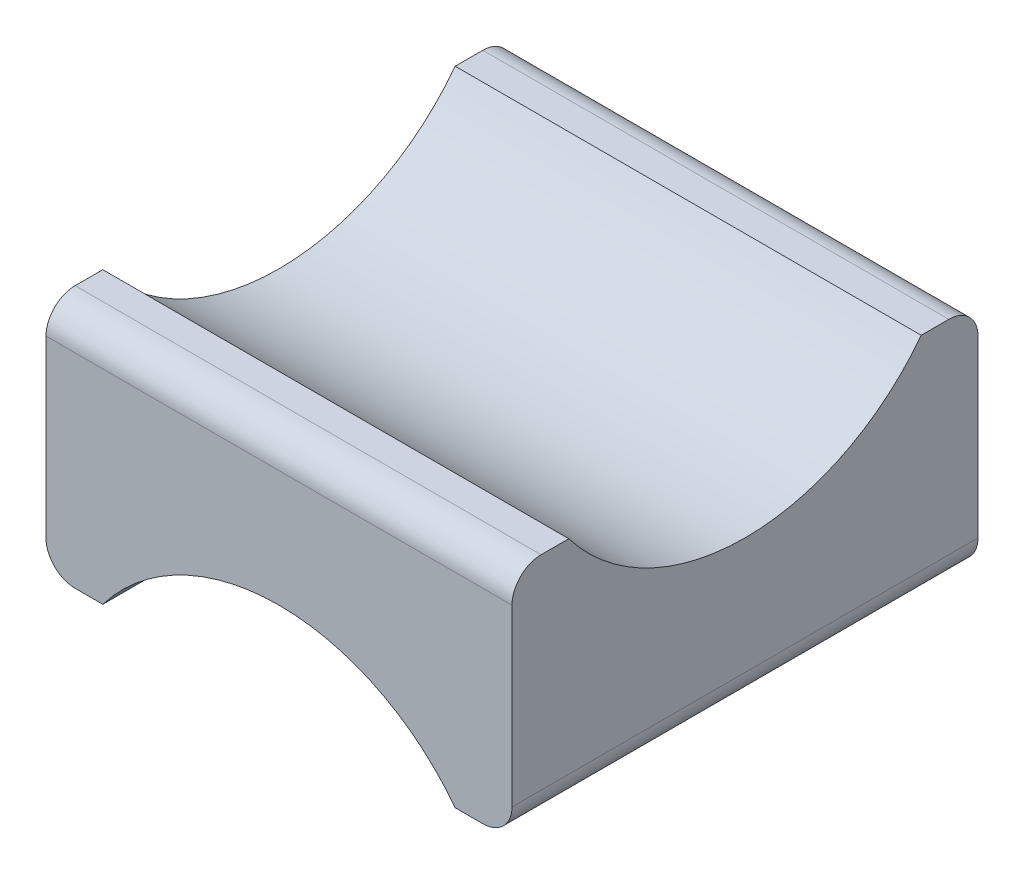
ISO-10303-21;
HEADER;
FILE_DESCRIPTION(('STEP AP214'),'2;1');
FILE_NAME('part.step','',(''),(''),'','','');
FILE_SCHEMA(('AUTOMOTIVE_DESIGN { 1 0 10303 214 1 1 1 1 }'));
ENDSEC;
DATA;
#1=APPLICATION_CONTEXT('core data for automotive mechanical design processes');
#2=APPLICATION_PROTOCOL_DEFINITION('international standard','automotive_design',2000,#1);
#3=PRODUCT_CONTEXT('',#1,'mechanical');
#4=PRODUCT('Part','Part','',(#3));
#5=PRODUCT_RELATED_PRODUCT_CATEGORY('part','',(#4));
#6=PRODUCT_DEFINITION_FORMATION('','',#4);
#7=PRODUCT_DEFINITION_CONTEXT('part definition',#1,'design');
#8=PRODUCT_DEFINITION('design','',#6,#7);
#9=PRODUCT_DEFINITION_SHAPE('','',#8);
#10=(LENGTH_UNIT() NAMED_UNIT(*) SI_UNIT(.MILLI.,.METRE.));
#11=(NAMED_UNIT(*) PLANE_ANGLE_UNIT() SI_UNIT($,.RADIAN.));
#12=(NAMED_UNIT(*) SI_UNIT($,.STERADIAN.) SOLID_ANGLE_UNIT());
#13=UNCERTAINTY_MEASURE_WITH_UNIT(LENGTH_MEASURE(1.E-05),#10,'distance_accuracy_value','');
#14=(GEOMETRIC_REPRESENTATION_CONTEXT(3) GLOBAL_UNCERTAINTY_ASSIGNED_CONTEXT((#13)) GLOBAL_UNIT_ASSIGNED_CONTEXT((#10,
#11,#12)) REPRESENTATION_CONTEXT('',''));
#15=CARTESIAN_POINT('',(0.,0.,0.));
#16=DIRECTION('',(0.,0.,1.));
#17=DIRECTION('',(1.,0.,0.));
#18=AXIS2_PLACEMENT_3D('',#15,#16,#17);
#19=CARTESIAN_POINT('',(8.,4.,8.));
#20=DIRECTION('',(0.,-1.,0.));
#21=DIRECTION('',(1.,0.,0.));
#22=AXIS2_PLACEMENT_3D('',#19,#20,#21);
#23=PLANE('',#22);
#24=DIRECTION('',(0.,0.,-1.));
#25=VECTOR('',#24,1.);
#26=CARTESIAN_POINT('',(-8.,4.,8.));
#27=LINE('',#26,#25);
#28=CARTESIAN_POINT('',(-8.,4.,7.));
#29=VERTEX_POINT('',#28);
#30=CARTESIAN_POINT('',(-8.,4.,6.04979338490167));
#31=VERTEX_POINT('',#30);
#32=EDGE_CURVE('E122',#29,#31,#27,.T.);
#33=ORIENTED_EDGE('',*,*,#32,.F.);
#34=DIRECTION('',(-1.,0.,0.));
#35=VECTOR('',#34,1.);
#36=CARTESIAN_POINT('',(8.,4.,7.));
#37=LINE('',#36,#35);
#38=CARTESIAN_POINT('',(8.,4.,7.));
#39=VERTEX_POINT('',#38);
#40=EDGE_CURVE('E40',#29,#39,#37,.F.);
#41=ORIENTED_EDGE('',*,*,#40,.T.);
#42=DIRECTION('',(0.,0.,-1.));
#43=VECTOR('',#42,1.);
#44=CARTESIAN_POINT('',(8.,4.,8.));
#45=LINE('',#44,#43);
#46=CARTESIAN_POINT('',(8.,4.,6.04979338490167));
#47=VERTEX_POINT('',#46);
#48=EDGE_CURVE('E143',#39,#47,#45,.T.);
#49=ORIENTED_EDGE('',*,*,#48,.T.);
#50=DIRECTION('',(-1.,0.,0.));
#51=VECTOR('',#50,1.);
#52=CARTESIAN_POINT('',(18.,4.,6.04979338490167));
#53=LINE('',#52,#51);
#54=EDGE_CURVE('E138',#47,#31,#53,.T.);
#55=ORIENTED_EDGE('',*,*,#54,.T.);
#56=EDGE_LOOP('',(#33,#41,#49,#55));
#57=FACE_BOUND('',#56,.T.);
#58=ADVANCED_FACE('F32',(#57),#23,.F.);
#59=CARTESIAN_POINT('',(8.,4.,8.));
#60=DIRECTION('',(-1.,0.,0.));
#61=DIRECTION('',(0.,0.,1.));
#62=AXIS2_PLACEMENT_3D('',#59,#60,#61);
#63=PLANE('',#62);
#64=DIRECTION('',(0.,1.,0.));
#65=VECTOR('',#64,1.);
#66=CARTESIAN_POINT('',(8.,4.,8.));
#67=LINE('',#66,#65);
#68=CARTESIAN_POINT('',(8.,-3.,8.));
#69=VERTEX_POINT('',#68);
#70=CARTESIAN_POINT('',(8.,3.,8.));
#71=VERTEX_POINT('',#70);
#72=EDGE_CURVE('E153',#69,#71,#67,.T.);
#73=ORIENTED_EDGE('',*,*,#72,.F.);
#74=DIRECTION('',(0.,0.,-1.));
#75=VECTOR('',#74,1.);
#76=CARTESIAN_POINT('',(8.,-3.,8.));
#77=LINE('',#76,#75);
#78=CARTESIAN_POINT('',(8.,-3.,-8.));
#79=VERTEX_POINT('',#78);
#80=EDGE_CURVE('E204',#69,#79,#77,.T.);
#81=ORIENTED_EDGE('',*,*,#80,.T.);
#82=DIRECTION('',(0.,1.,0.));
#83=VECTOR('',#82,1.);
#84=CARTESIAN_POINT('',(8.,4.,-8.));
#85=LINE('',#84,#83);
#86=CARTESIAN_POINT('',(8.,3.,-8.));
#87=VERTEX_POINT('',#86);
#88=EDGE_CURVE('E145',#79,#87,#85,.T.);
#89=ORIENTED_EDGE('',*,*,#88,.T.);
#90=CARTESIAN_POINT('',(8.,3.,-7.));
#91=DIRECTION('',(-1.,0.,0.));
#92=DIRECTION('',(0.,0.,1.));
#93=AXIS2_PLACEMENT_3D('',#90,#91,#92);
#94=CIRCLE('',#93,1.);
#95=CARTESIAN_POINT('',(8.,4.,-7.));
#96=VERTEX_POINT('',#95);
#97=EDGE_CURVE('E54',#87,#96,#94,.F.);
#98=ORIENTED_EDGE('',*,*,#97,.T.);
#99=CARTESIAN_POINT('',(8.,4.,-6.04979338490167));
#100=VERTEX_POINT('',#99);
#101=EDGE_CURVE('E132',#100,#96,#45,.T.);
#102=ORIENTED_EDGE('',*,*,#101,.F.);
#103=CARTESIAN_POINT('',(8.,8.6,0.));
#104=DIRECTION('',(-1.,0.,0.));
#105=DIRECTION('',(0.,0.,1.));
#106=AXIS2_PLACEMENT_3D('',#103,#104,#105);
#107=CIRCLE('',#106,7.6);
#108=EDGE_CURVE('E146',#100,#47,#107,.T.);
#109=ORIENTED_EDGE('',*,*,#108,.T.);
#110=ORIENTED_EDGE('',*,*,#48,.F.);
#111=CARTESIAN_POINT('',(8.,3.,7.));
#112=DIRECTION('',(-1.,0.,0.));
#113=DIRECTION('',(0.,0.,1.));
#114=AXIS2_PLACEMENT_3D('',#111,#112,#113);
#115=CIRCLE('',#114,1.);
#116=EDGE_CURVE('E202',#39,#71,#115,.F.);
#117=ORIENTED_EDGE('',*,*,#116,.T.);
#118=EDGE_LOOP('',(#73,#81,#89,#98,#102,#109,#110,#117));
#119=FACE_BOUND('',#118,.T.);
#120=ADVANCED_FACE('F223',(#119),#63,.F.);
#121=ORIENTED_EDGE('',*,*,#101,.T.);
#122=DIRECTION('',(-1.,0.,0.));
#123=VECTOR('',#122,1.);
#124=CARTESIAN_POINT('',(8.,4.,-7.));
#125=LINE('',#124,#123);
#126=CARTESIAN_POINT('',(-8.,4.,-7.));
#127=VERTEX_POINT('',#126);
#128=EDGE_CURVE('E11',#96,#127,#125,.T.);
#129=ORIENTED_EDGE('',*,*,#128,.T.);
#130=CARTESIAN_POINT('',(-8.,4.,-6.04979338490167));
#131=VERTEX_POINT('',#130);
#132=EDGE_CURVE('E133',#131,#127,#27,.T.);
#133=ORIENTED_EDGE('',*,*,#132,.F.);
#134=DIRECTION('',(-1.,0.,0.));
#135=VECTOR('',#134,1.);
#136=CARTESIAN_POINT('',(18.,4.,-6.04979338490167));
#137=LINE('',#136,#135);
#138=EDGE_CURVE('E141',#131,#100,#137,.F.);
#139=ORIENTED_EDGE('',*,*,#138,.T.);
#140=EDGE_LOOP('',(#121,#129,#133,#139));
#141=FACE_BOUND('',#140,.T.);
#142=ADVANCED_FACE('F232',(#141),#23,.F.);
#143=CARTESIAN_POINT('',(-8.,4.,8.));
#144=DIRECTION('',(1.,0.,0.));
#145=DIRECTION('',(0.,0.,-1.));
#146=AXIS2_PLACEMENT_3D('',#143,#144,#145);
#147=PLANE('',#146);
#148=DIRECTION('',(0.,-1.,0.));
#149=VECTOR('',#148,1.);
#150=CARTESIAN_POINT('',(-8.,4.,-8.));
#151=LINE('',#150,#149);
#152=CARTESIAN_POINT('',(-8.,3.,-8.));
#153=VERTEX_POINT('',#152);
#154=CARTESIAN_POINT('',(-8.,-3.,-8.));
#155=VERTEX_POINT('',#154);
#156=EDGE_CURVE('E148',#153,#155,#151,.T.);
#157=ORIENTED_EDGE('',*,*,#156,.T.);
#158=DIRECTION('',(0.,0.,-1.));
#159=VECTOR('',#158,1.);
#160=CARTESIAN_POINT('',(-8.,-3.,8.));
#161=LINE('',#160,#159);
#162=CARTESIAN_POINT('',(-8.,-3.,8.));
#163=VERTEX_POINT('',#162);
#164=EDGE_CURVE('E192',#155,#163,#161,.F.);
#165=ORIENTED_EDGE('',*,*,#164,.T.);
#166=DIRECTION('',(0.,-1.,0.));
#167=VECTOR('',#166,1.);
#168=CARTESIAN_POINT('',(-8.,4.,8.));
#169=LINE('',#168,#167);
#170=CARTESIAN_POINT('',(-8.,3.,8.));
#171=VERTEX_POINT('',#170);
#172=EDGE_CURVE('E156',#171,#163,#169,.T.);
#173=ORIENTED_EDGE('',*,*,#172,.F.);
#174=CARTESIAN_POINT('',(-8.,3.,7.));
#175=DIRECTION('',(1.,0.,0.));
#176=DIRECTION('',(0.,0.,-1.));
#177=AXIS2_PLACEMENT_3D('',#174,#175,#176);
#178=CIRCLE('',#177,1.);
#179=EDGE_CURVE('E130',#171,#29,#178,.F.);
#180=ORIENTED_EDGE('',*,*,#179,.T.);
#181=ORIENTED_EDGE('',*,*,#32,.T.);
#182=CARTESIAN_POINT('',(-8.,8.6,0.));
#183=DIRECTION('',(1.,0.,0.));
#184=DIRECTION('',(0.,0.,-1.));
#185=AXIS2_PLACEMENT_3D('',#182,#183,#184);
#186=CIRCLE('',#185,7.6);
#187=EDGE_CURVE('E127',#31,#131,#186,.T.);
#188=ORIENTED_EDGE('',*,*,#187,.T.);
#189=ORIENTED_EDGE('',*,*,#132,.T.);
#190=CARTESIAN_POINT('',(-8.,3.,-7.));
#191=DIRECTION('',(1.,0.,0.));
#192=DIRECTION('',(0.,0.,-1.));
#193=AXIS2_PLACEMENT_3D('',#190,#191,#192);
#194=CIRCLE('',#193,1.);
#195=EDGE_CURVE('E189',#127,#153,#194,.F.);
#196=ORIENTED_EDGE('',*,*,#195,.T.);
#197=EDGE_LOOP('',(#157,#165,#173,#180,#181,#188,#189,#196));
#198=FACE_BOUND('',#197,.T.);
#199=ADVANCED_FACE('F125',(#198),#147,.F.);
#200=CARTESIAN_POINT('',(-6.04979338490167,-4.,8.));
#201=DIRECTION('',(0.,1.,0.));
#202=DIRECTION('',(-1.,0.,0.));
#203=AXIS2_PLACEMENT_3D('',#200,#201,#202);
#204=PLANE('',#203);
#205=DIRECTION('',(1.,0.,0.));
#206=VECTOR('',#205,1.);
#207=CARTESIAN_POINT('',(-6.04979338490167,-4.,8.));
#208=LINE('',#207,#206);
#209=CARTESIAN_POINT('',(-7.,-4.,8.));
#210=VERTEX_POINT('',#209);
#211=CARTESIAN_POINT('',(-6.04979338490167,-4.,8.));
#212=VERTEX_POINT('',#211);
#213=EDGE_CURVE('E160',#210,#212,#208,.T.);
#214=ORIENTED_EDGE('',*,*,#213,.F.);
#215=DIRECTION('',(0.,0.,-1.));
#216=VECTOR('',#215,1.);
#217=CARTESIAN_POINT('',(-7.,-4.,8.));
#218=LINE('',#217,#216);
#219=CARTESIAN_POINT('',(-7.,-4.,-8.));
#220=VERTEX_POINT('',#219);
#221=EDGE_CURVE('E142',#210,#220,#218,.T.);
#222=ORIENTED_EDGE('',*,*,#221,.T.);
#223=DIRECTION('',(1.,0.,0.));
#224=VECTOR('',#223,1.);
#225=CARTESIAN_POINT('',(-6.04979338490167,-4.,-8.));
#226=LINE('',#225,#224);
#227=CARTESIAN_POINT('',(-6.04979338490167,-4.,-8.));
#228=VERTEX_POINT('',#227);
#229=EDGE_CURVE('E169',#220,#228,#226,.T.);
#230=ORIENTED_EDGE('',*,*,#229,.T.);
#231=DIRECTION('',(0.,0.,-1.));
#232=VECTOR('',#231,1.);
#233=CARTESIAN_POINT('',(-6.04979338490167,-4.,8.));
#234=LINE('',#233,#232);
#235=EDGE_CURVE('E177',#212,#228,#234,.T.);
#236=ORIENTED_EDGE('',*,*,#235,.F.);
#237=EDGE_LOOP('',(#214,#222,#230,#236));
#238=FACE_BOUND('',#237,.T.);
#239=ADVANCED_FACE('F241',(#238),#204,.F.);
#240=CARTESIAN_POINT('',(0.,-8.6,8.));
#241=DIRECTION('',(0.,0.,-1.));
#242=DIRECTION('',(-1.,0.,0.));
#243=AXIS2_PLACEMENT_3D('',#240,#241,#242);
#244=CYLINDRICAL_SURFACE('',#243,7.6);
#245=CARTESIAN_POINT('',(0.,-8.6,-8.));
#246=DIRECTION('',(0.,0.,-1.));
#247=DIRECTION('',(1.,0.,0.));
#248=AXIS2_PLACEMENT_3D('',#245,#246,#247);
#249=CIRCLE('',#248,7.6);
#250=CARTESIAN_POINT('',(6.04979338490167,-4.,-8.));
#251=VERTEX_POINT('',#250);
#252=EDGE_CURVE('E171',#228,#251,#249,.T.);
#253=ORIENTED_EDGE('',*,*,#252,.T.);
#254=DIRECTION('',(0.,0.,-1.));
#255=VECTOR('',#254,1.);
#256=CARTESIAN_POINT('',(6.04979338490167,-4.,8.));
#257=LINE('',#256,#255);
#258=CARTESIAN_POINT('',(6.04979338490167,-4.,8.));
#259=VERTEX_POINT('',#258);
#260=EDGE_CURVE('E166',#259,#251,#257,.T.);
#261=ORIENTED_EDGE('',*,*,#260,.F.);
#262=CARTESIAN_POINT('',(0.,-8.6,8.));
#263=DIRECTION('',(0.,0.,-1.));
#264=DIRECTION('',(1.,0.,0.));
#265=AXIS2_PLACEMENT_3D('',#262,#263,#264);
#266=CIRCLE('',#265,7.6);
#267=EDGE_CURVE('E162',#212,#259,#266,.T.);
#268=ORIENTED_EDGE('',*,*,#267,.F.);
#269=ORIENTED_EDGE('',*,*,#235,.T.);
#270=EDGE_LOOP('',(#253,#261,#268,#269));
#271=FACE_BOUND('',#270,.T.);
#272=ADVANCED_FACE('F244',(#271),#244,.F.);
#273=CARTESIAN_POINT('',(8.,-4.,8.));
#274=DIRECTION('',(0.,1.,0.));
#275=DIRECTION('',(-1.,0.,0.));
#276=AXIS2_PLACEMENT_3D('',#273,#274,#275);
#277=PLANE('',#276);
#278=DIRECTION('',(1.,0.,0.));
#279=VECTOR('',#278,1.);
#280=CARTESIAN_POINT('',(8.,-4.,-8.));
#281=LINE('',#280,#279);
#282=CARTESIAN_POINT('',(7.,-4.,-8.));
#283=VERTEX_POINT('',#282);
#284=EDGE_CURVE('E157',#251,#283,#281,.T.);
#285=ORIENTED_EDGE('',*,*,#284,.T.);
#286=DIRECTION('',(0.,0.,-1.));
#287=VECTOR('',#286,1.);
#288=CARTESIAN_POINT('',(7.,-4.,8.));
#289=LINE('',#288,#287);
#290=CARTESIAN_POINT('',(7.,-4.,8.));
#291=VERTEX_POINT('',#290);
#292=EDGE_CURVE('E207',#283,#291,#289,.F.);
#293=ORIENTED_EDGE('',*,*,#292,.T.);
#294=DIRECTION('',(1.,0.,0.));
#295=VECTOR('',#294,1.);
#296=CARTESIAN_POINT('',(8.,-4.,8.));
#297=LINE('',#296,#295);
#298=EDGE_CURVE('E164',#259,#291,#297,.T.);
#299=ORIENTED_EDGE('',*,*,#298,.F.);
#300=ORIENTED_EDGE('',*,*,#260,.T.);
#301=EDGE_LOOP('',(#285,#293,#299,#300));
#302=FACE_BOUND('',#301,.T.);
#303=ADVANCED_FACE('F211',(#302),#277,.F.);
#304=CARTESIAN_POINT('',(0.,-8.6,8.));
#305=DIRECTION('',(0.,0.,1.));
#306=DIRECTION('',(1.,0.,0.));
#307=AXIS2_PLACEMENT_3D('',#304,#305,#306);
#308=PLANE('',#307);
#309=ORIENTED_EDGE('',*,*,#172,.T.);
#310=CARTESIAN_POINT('',(-7.,-3.,8.));
#311=DIRECTION('',(0.,0.,1.));
#312=DIRECTION('',(1.,0.,0.));
#313=AXIS2_PLACEMENT_3D('',#310,#311,#312);
#314=CIRCLE('',#313,1.);
#315=EDGE_CURVE('E199',#163,#210,#314,.T.);
#316=ORIENTED_EDGE('',*,*,#315,.T.);
#317=ORIENTED_EDGE('',*,*,#213,.T.);
#318=ORIENTED_EDGE('',*,*,#267,.T.);
#319=ORIENTED_EDGE('',*,*,#298,.T.);
#320=CARTESIAN_POINT('',(7.,-3.,8.));
#321=DIRECTION('',(0.,0.,1.));
#322=DIRECTION('',(1.,0.,0.));
#323=AXIS2_PLACEMENT_3D('',#320,#321,#322);
#324=CIRCLE('',#323,1.);
#325=EDGE_CURVE('E197',#291,#69,#324,.T.);
#326=ORIENTED_EDGE('',*,*,#325,.T.);
#327=ORIENTED_EDGE('',*,*,#72,.T.);
#328=DIRECTION('',(-1.,0.,0.));
#329=VECTOR('',#328,1.);
#330=CARTESIAN_POINT('',(-8.,3.,8.));
#331=LINE('',#330,#329);
#332=EDGE_CURVE('E194',#71,#171,#331,.T.);
#333=ORIENTED_EDGE('',*,*,#332,.T.);
#334=EDGE_LOOP('',(#309,#316,#317,#318,#319,#326,#327,#333));
#335=FACE_BOUND('',#334,.T.);
#336=ADVANCED_FACE('F216',(#335),#308,.T.);
#337=CARTESIAN_POINT('',(0.,-8.6,-8.));
#338=DIRECTION('',(0.,0.,1.));
#339=DIRECTION('',(1.,0.,0.));
#340=AXIS2_PLACEMENT_3D('',#337,#338,#339);
#341=PLANE('',#340);
#342=ORIENTED_EDGE('',*,*,#229,.F.);
#343=CARTESIAN_POINT('',(-7.,-3.,-8.));
#344=DIRECTION('',(0.,0.,1.));
#345=DIRECTION('',(1.,0.,0.));
#346=AXIS2_PLACEMENT_3D('',#343,#344,#345);
#347=CIRCLE('',#346,1.);
#348=EDGE_CURVE('E187',#220,#155,#347,.F.);
#349=ORIENTED_EDGE('',*,*,#348,.T.);
#350=ORIENTED_EDGE('',*,*,#156,.F.);
#351=DIRECTION('',(-1.,0.,0.));
#352=VECTOR('',#351,1.);
#353=CARTESIAN_POINT('',(0.,3.,-8.));
#354=LINE('',#353,#352);
#355=EDGE_CURVE('E183',#153,#87,#354,.F.);
#356=ORIENTED_EDGE('',*,*,#355,.T.);
#357=ORIENTED_EDGE('',*,*,#88,.F.);
#358=CARTESIAN_POINT('',(7.,-3.,-8.));
#359=DIRECTION('',(0.,0.,1.));
#360=DIRECTION('',(1.,0.,0.));
#361=AXIS2_PLACEMENT_3D('',#358,#359,#360);
#362=CIRCLE('',#361,1.);
#363=EDGE_CURVE('E185',#79,#283,#362,.F.);
#364=ORIENTED_EDGE('',*,*,#363,.T.);
#365=ORIENTED_EDGE('',*,*,#284,.F.);
#366=ORIENTED_EDGE('',*,*,#252,.F.);
#367=EDGE_LOOP('',(#342,#349,#350,#356,#357,#364,#365,#366));
#368=FACE_BOUND('',#367,.T.);
#369=ADVANCED_FACE('F226',(#368),#341,.F.);
#370=CARTESIAN_POINT('',(18.,8.6,0.));
#371=DIRECTION('',(-1.,0.,0.));
#372=DIRECTION('',(0.,-1.,0.));
#373=AXIS2_PLACEMENT_3D('',#370,#371,#372);
#374=CYLINDRICAL_SURFACE('',#373,7.6);
#375=ORIENTED_EDGE('',*,*,#108,.F.);
#376=ORIENTED_EDGE('',*,*,#138,.F.);
#377=ORIENTED_EDGE('',*,*,#187,.F.);
#378=ORIENTED_EDGE('',*,*,#54,.F.);
#379=EDGE_LOOP('',(#375,#376,#377,#378));
#380=FACE_BOUND('',#379,.T.);
#381=ADVANCED_FACE('F137',(#380),#374,.F.);
#382=CARTESIAN_POINT('',(-7.,-3.,8.));
#383=DIRECTION('',(0.,0.,-1.));
#384=DIRECTION('',(-1.,0.,0.));
#385=AXIS2_PLACEMENT_3D('',#382,#383,#384);
#386=CYLINDRICAL_SURFACE('',#385,1.);
#387=ORIENTED_EDGE('',*,*,#315,.F.);
#388=ORIENTED_EDGE('',*,*,#164,.F.);
#389=ORIENTED_EDGE('',*,*,#348,.F.);
#390=ORIENTED_EDGE('',*,*,#221,.F.);
#391=EDGE_LOOP('',(#387,#388,#389,#390));
#392=FACE_BOUND('',#391,.T.);
#393=ADVANCED_FACE('F236',(#392),#386,.T.);
#394=CARTESIAN_POINT('',(7.,-3.,8.));
#395=DIRECTION('',(0.,0.,-1.));
#396=DIRECTION('',(-1.,0.,0.));
#397=AXIS2_PLACEMENT_3D('',#394,#395,#396);
#398=CYLINDRICAL_SURFACE('',#397,1.);
#399=ORIENTED_EDGE('',*,*,#325,.F.);
#400=ORIENTED_EDGE('',*,*,#292,.F.);
#401=ORIENTED_EDGE('',*,*,#363,.F.);
#402=ORIENTED_EDGE('',*,*,#80,.F.);
#403=EDGE_LOOP('',(#399,#400,#401,#402));
#404=FACE_BOUND('',#403,.T.);
#405=ADVANCED_FACE('F221',(#404),#398,.T.);
#406=CARTESIAN_POINT('',(0.,3.,7.));
#407=DIRECTION('',(1.,0.,0.));
#408=DIRECTION('',(0.,1.,0.));
#409=AXIS2_PLACEMENT_3D('',#406,#407,#408);
#410=CYLINDRICAL_SURFACE('',#409,1.);
#411=ORIENTED_EDGE('',*,*,#116,.F.);
#412=ORIENTED_EDGE('',*,*,#40,.F.);
#413=ORIENTED_EDGE('',*,*,#179,.F.);
#414=ORIENTED_EDGE('',*,*,#332,.F.);
#415=EDGE_LOOP('',(#411,#412,#413,#414));
#416=FACE_BOUND('',#415,.T.);
#417=ADVANCED_FACE('F313',(#416),#410,.T.);
#418=CARTESIAN_POINT('',(8.,3.,-7.));
#419=DIRECTION('',(-1.,0.,0.));
#420=DIRECTION('',(0.,-1.,0.));
#421=AXIS2_PLACEMENT_3D('',#418,#419,#420);
#422=CYLINDRICAL_SURFACE('',#421,1.);
#423=ORIENTED_EDGE('',*,*,#97,.F.);
#424=ORIENTED_EDGE('',*,*,#355,.F.);
#425=ORIENTED_EDGE('',*,*,#195,.F.);
#426=ORIENTED_EDGE('',*,*,#128,.F.);
#427=EDGE_LOOP('',(#423,#424,#425,#426));
#428=FACE_BOUND('',#427,.T.);
#429=ADVANCED_FACE('F34',(#428),#422,.T.);
#430=CLOSED_SHELL('',(#58,#120,#142,#199,#239,#272,#303,#336,#369,#381,#393,#405,#417,#429));
#431=MANIFOLD_SOLID_BREP('B2',#430);
#432=ADVANCED_BREP_SHAPE_REPRESENTATION('',(#18,#431),#14);
#433=SHAPE_DEFINITION_REPRESENTATION(#9,#432);
ENDSEC;
END-ISO-10303-21;
